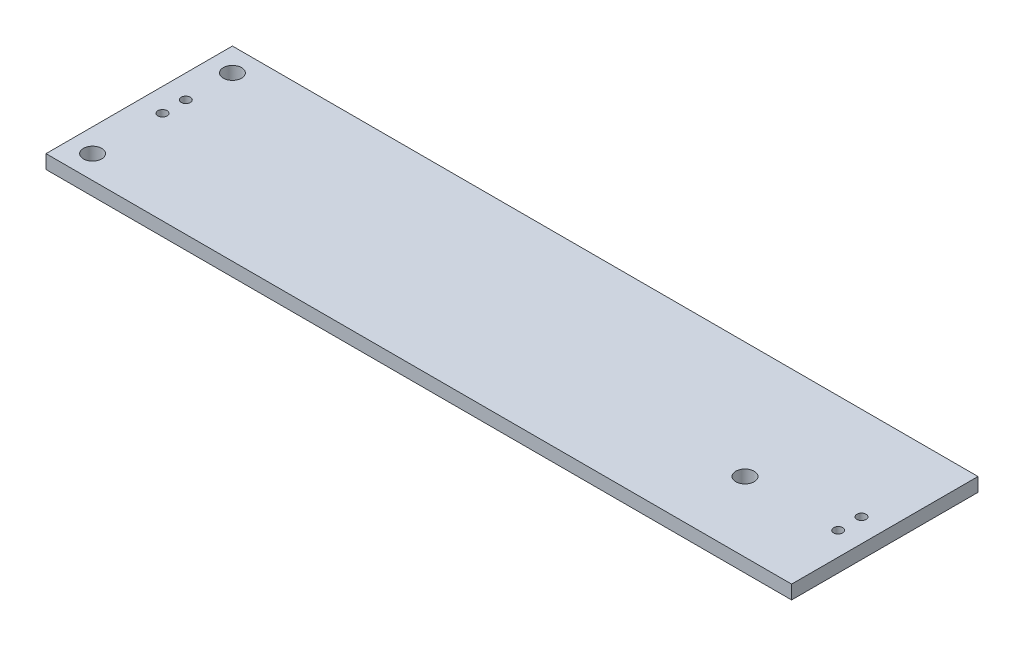
ISO-10303-21;
HEADER;
FILE_DESCRIPTION(('STEP AP214'),'2;1');
FILE_NAME('part.step','',(''),(''),'','','');
FILE_SCHEMA(('AUTOMOTIVE_DESIGN { 1 0 10303 214 1 1 1 1 }'));
ENDSEC;
DATA;
#1=APPLICATION_CONTEXT('core data for automotive mechanical design processes');
#2=APPLICATION_PROTOCOL_DEFINITION('international standard','automotive_design',2000,#1);
#3=PRODUCT_CONTEXT('',#1,'mechanical');
#4=PRODUCT('Part','Part','',(#3));
#5=PRODUCT_RELATED_PRODUCT_CATEGORY('part','',(#4));
#6=PRODUCT_DEFINITION_FORMATION('','',#4);
#7=PRODUCT_DEFINITION_CONTEXT('part definition',#1,'design');
#8=PRODUCT_DEFINITION('design','',#6,#7);
#9=PRODUCT_DEFINITION_SHAPE('','',#8);
#10=(LENGTH_UNIT() NAMED_UNIT(*) SI_UNIT(.MILLI.,.METRE.));
#11=(NAMED_UNIT(*) PLANE_ANGLE_UNIT() SI_UNIT($,.RADIAN.));
#12=(NAMED_UNIT(*) SI_UNIT($,.STERADIAN.) SOLID_ANGLE_UNIT());
#13=UNCERTAINTY_MEASURE_WITH_UNIT(LENGTH_MEASURE(1.E-05),#10,'distance_accuracy_value','');
#14=(GEOMETRIC_REPRESENTATION_CONTEXT(3) GLOBAL_UNCERTAINTY_ASSIGNED_CONTEXT((#13)) GLOBAL_UNIT_ASSIGNED_CONTEXT((#10,
#11,#12)) REPRESENTATION_CONTEXT('',''));
#15=CARTESIAN_POINT('',(0.,0.,0.));
#16=DIRECTION('',(0.,0.,1.));
#17=DIRECTION('',(1.,0.,0.));
#18=AXIS2_PLACEMENT_3D('',#15,#16,#17);
#19=CARTESIAN_POINT('',(2.54,-1.5,-17.78));
#20=DIRECTION('',(0.,1.,0.));
#21=DIRECTION('',(0.,0.,1.));
#22=AXIS2_PLACEMENT_3D('',#19,#20,#21);
#23=CYLINDRICAL_SURFACE('',#22,0.999999999999999);
#24=CARTESIAN_POINT('',(2.54,-1.5,-17.78));
#25=DIRECTION('',(0.,1.,0.));
#26=DIRECTION('',(0.,0.,1.));
#27=AXIS2_PLACEMENT_3D('',#24,#25,#26);
#28=CIRCLE('',#27,0.999999999999999);
#29=CARTESIAN_POINT('',(2.54,-1.5,-16.78));
#30=VERTEX_POINT('',#29);
#31=EDGE_CURVE('E474',#30,#30,#28,.F.);
#32=ORIENTED_EDGE('',*,*,#31,.T.);
#33=EDGE_LOOP('',(#32));
#34=FACE_BOUND('',#33,.T.);
#35=CARTESIAN_POINT('',(2.54,0.,-17.78));
#36=DIRECTION('',(0.,1.,0.));
#37=DIRECTION('',(0.,0.,1.));
#38=AXIS2_PLACEMENT_3D('',#35,#36,#37);
#39=CIRCLE('',#38,0.999999999999999);
#40=CARTESIAN_POINT('',(2.54,0.,-16.78));
#41=VERTEX_POINT('',#40);
#42=EDGE_CURVE('E463',#41,#41,#39,.F.);
#43=ORIENTED_EDGE('',*,*,#42,.F.);
#44=EDGE_LOOP('',(#43));
#45=FACE_BOUND('',#44,.T.);
#46=ADVANCED_FACE('F399',(#34,#45),#23,.F.);
#47=CARTESIAN_POINT('',(68.58,-1.5,-7.62));
#48=DIRECTION('',(0.,1.,0.));
#49=DIRECTION('',(0.,0.,1.));
#50=AXIS2_PLACEMENT_3D('',#47,#48,#49);
#51=CYLINDRICAL_SURFACE('',#50,0.999999999999998);
#52=CARTESIAN_POINT('',(68.58,-1.5,-7.62));
#53=DIRECTION('',(0.,1.,0.));
#54=DIRECTION('',(0.,0.,1.));
#55=AXIS2_PLACEMENT_3D('',#52,#53,#54);
#56=CIRCLE('',#55,0.999999999999998);
#57=CARTESIAN_POINT('',(68.58,-1.5,-6.62));
#58=VERTEX_POINT('',#57);
#59=EDGE_CURVE('E471',#58,#58,#56,.T.);
#60=ORIENTED_EDGE('',*,*,#59,.F.);
#61=EDGE_LOOP('',(#60));
#62=FACE_BOUND('',#61,.T.);
#63=CARTESIAN_POINT('',(68.58,0.,-7.62));
#64=DIRECTION('',(0.,1.,0.));
#65=DIRECTION('',(0.,0.,1.));
#66=AXIS2_PLACEMENT_3D('',#63,#64,#65);
#67=CIRCLE('',#66,0.999999999999998);
#68=CARTESIAN_POINT('',(68.58,0.,-6.62));
#69=VERTEX_POINT('',#68);
#70=EDGE_CURVE('E489',#69,#69,#67,.T.);
#71=ORIENTED_EDGE('',*,*,#70,.T.);
#72=EDGE_LOOP('',(#71));
#73=FACE_BOUND('',#72,.T.);
#74=ADVANCED_FACE('F505',(#62,#73),#51,.F.);
#75=CARTESIAN_POINT('',(2.54,-1.5,-2.54));
#76=DIRECTION('',(0.,1.,0.));
#77=DIRECTION('',(0.,0.,1.));
#78=AXIS2_PLACEMENT_3D('',#75,#76,#77);
#79=CYLINDRICAL_SURFACE('',#78,1.);
#80=CARTESIAN_POINT('',(2.54,-1.5,-2.54));
#81=DIRECTION('',(0.,1.,0.));
#82=DIRECTION('',(0.,0.,1.));
#83=AXIS2_PLACEMENT_3D('',#80,#81,#82);
#84=CIRCLE('',#83,1.);
#85=CARTESIAN_POINT('',(2.54,-1.5,-1.54));
#86=VERTEX_POINT('',#85);
#87=EDGE_CURVE('E468',#86,#86,#84,.T.);
#88=ORIENTED_EDGE('',*,*,#87,.F.);
#89=EDGE_LOOP('',(#88));
#90=FACE_BOUND('',#89,.T.);
#91=CARTESIAN_POINT('',(2.54,0.,-2.54));
#92=DIRECTION('',(0.,1.,0.));
#93=DIRECTION('',(0.,0.,1.));
#94=AXIS2_PLACEMENT_3D('',#91,#92,#93);
#95=CIRCLE('',#94,1.);
#96=CARTESIAN_POINT('',(2.54,0.,-1.54));
#97=VERTEX_POINT('',#96);
#98=EDGE_CURVE('E486',#97,#97,#95,.T.);
#99=ORIENTED_EDGE('',*,*,#98,.T.);
#100=EDGE_LOOP('',(#99));
#101=FACE_BOUND('',#100,.T.);
#102=ADVANCED_FACE('F511',(#90,#101),#79,.F.);
#103=CARTESIAN_POINT('',(0.,-1.5,0.));
#104=DIRECTION('',(1.,0.,0.));
#105=DIRECTION('',(0.,0.,-1.));
#106=AXIS2_PLACEMENT_3D('',#103,#104,#105);
#107=PLANE('',#106);
#108=DIRECTION('',(0.,0.,-1.));
#109=VECTOR('',#108,1.);
#110=CARTESIAN_POINT('',(0.,0.,0.));
#111=LINE('',#110,#109);
#112=CARTESIAN_POINT('',(0.,0.,0.));
#113=VERTEX_POINT('',#112);
#114=CARTESIAN_POINT('',(0.,0.,-20.32));
#115=VERTEX_POINT('',#114);
#116=EDGE_CURVE('E484',#113,#115,#111,.T.);
#117=ORIENTED_EDGE('',*,*,#116,.T.);
#118=DIRECTION('',(0.,1.,0.));
#119=VECTOR('',#118,1.);
#120=CARTESIAN_POINT('',(0.,-1.5,-20.32));
#121=LINE('',#120,#119);
#122=CARTESIAN_POINT('',(0.,-1.5,-20.32));
#123=VERTEX_POINT('',#122);
#124=EDGE_CURVE('E409',#123,#115,#121,.T.);
#125=ORIENTED_EDGE('',*,*,#124,.F.);
#126=DIRECTION('',(0.,0.,-1.));
#127=VECTOR('',#126,1.);
#128=CARTESIAN_POINT('',(0.,-1.5,0.));
#129=LINE('',#128,#127);
#130=CARTESIAN_POINT('',(0.,-1.5,0.));
#131=VERTEX_POINT('',#130);
#132=EDGE_CURVE('E454',#131,#123,#129,.T.);
#133=ORIENTED_EDGE('',*,*,#132,.F.);
#134=DIRECTION('',(0.,1.,0.));
#135=VECTOR('',#134,1.);
#136=CARTESIAN_POINT('',(0.,-1.5,0.));
#137=LINE('',#136,#135);
#138=EDGE_CURVE('E12',#131,#113,#137,.T.);
#139=ORIENTED_EDGE('',*,*,#138,.T.);
#140=EDGE_LOOP('',(#117,#125,#133,#139));
#141=FACE_BOUND('',#140,.T.);
#142=ADVANCED_FACE('F494',(#141),#107,.F.);
#143=CARTESIAN_POINT('',(0.,-1.5,-20.32));
#144=DIRECTION('',(0.,0.,1.));
#145=DIRECTION('',(1.,0.,0.));
#146=AXIS2_PLACEMENT_3D('',#143,#144,#145);
#147=PLANE('',#146);
#148=DIRECTION('',(1.,0.,0.));
#149=VECTOR('',#148,1.);
#150=CARTESIAN_POINT('',(0.,0.,-20.32));
#151=LINE('',#150,#149);
#152=CARTESIAN_POINT('',(81.28,0.,-20.32));
#153=VERTEX_POINT('',#152);
#154=EDGE_CURVE('E434',#115,#153,#151,.T.);
#155=ORIENTED_EDGE('',*,*,#154,.T.);
#156=DIRECTION('',(0.,1.,0.));
#157=VECTOR('',#156,1.);
#158=CARTESIAN_POINT('',(81.28,-1.5,-20.32));
#159=LINE('',#158,#157);
#160=CARTESIAN_POINT('',(81.28,-1.5,-20.32));
#161=VERTEX_POINT('',#160);
#162=EDGE_CURVE('E458',#161,#153,#159,.T.);
#163=ORIENTED_EDGE('',*,*,#162,.F.);
#164=DIRECTION('',(1.,0.,0.));
#165=VECTOR('',#164,1.);
#166=CARTESIAN_POINT('',(0.,-1.5,-20.32));
#167=LINE('',#166,#165);
#168=EDGE_CURVE('E448',#123,#161,#167,.T.);
#169=ORIENTED_EDGE('',*,*,#168,.F.);
#170=ORIENTED_EDGE('',*,*,#124,.T.);
#171=EDGE_LOOP('',(#155,#163,#169,#170));
#172=FACE_BOUND('',#171,.T.);
#173=ADVANCED_FACE('F459',(#172),#147,.F.);
#174=CARTESIAN_POINT('',(81.28,-1.5,0.));
#175=DIRECTION('',(1.,0.,0.));
#176=DIRECTION('',(0.,0.,-1.));
#177=AXIS2_PLACEMENT_3D('',#174,#175,#176);
#178=PLANE('',#177);
#179=DIRECTION('',(0.,0.,-1.));
#180=VECTOR('',#179,1.);
#181=CARTESIAN_POINT('',(81.28,0.,0.));
#182=LINE('',#181,#180);
#183=CARTESIAN_POINT('',(81.28,0.,0.));
#184=VERTEX_POINT('',#183);
#185=EDGE_CURVE('E480',#184,#153,#182,.T.);
#186=ORIENTED_EDGE('',*,*,#185,.F.);
#187=DIRECTION('',(0.,1.,0.));
#188=VECTOR('',#187,1.);
#189=CARTESIAN_POINT('',(81.28,-1.5,0.));
#190=LINE('',#189,#188);
#191=CARTESIAN_POINT('',(81.28,-1.5,0.));
#192=VERTEX_POINT('',#191);
#193=EDGE_CURVE('E403',#192,#184,#190,.T.);
#194=ORIENTED_EDGE('',*,*,#193,.F.);
#195=DIRECTION('',(0.,0.,-1.));
#196=VECTOR('',#195,1.);
#197=CARTESIAN_POINT('',(81.28,-1.5,0.));
#198=LINE('',#197,#196);
#199=EDGE_CURVE('E453',#192,#161,#198,.T.);
#200=ORIENTED_EDGE('',*,*,#199,.T.);
#201=ORIENTED_EDGE('',*,*,#162,.T.);
#202=EDGE_LOOP('',(#186,#194,#200,#201));
#203=FACE_BOUND('',#202,.T.);
#204=ADVANCED_FACE('F460',(#203),#178,.T.);
#205=CARTESIAN_POINT('',(0.,-1.5,0.));
#206=DIRECTION('',(0.,0.,1.));
#207=DIRECTION('',(1.,0.,0.));
#208=AXIS2_PLACEMENT_3D('',#205,#206,#207);
#209=PLANE('',#208);
#210=DIRECTION('',(1.,0.,0.));
#211=VECTOR('',#210,1.);
#212=CARTESIAN_POINT('',(0.,0.,0.));
#213=LINE('',#212,#211);
#214=EDGE_CURVE('E477',#113,#184,#213,.T.);
#215=ORIENTED_EDGE('',*,*,#214,.F.);
#216=ORIENTED_EDGE('',*,*,#138,.F.);
#217=DIRECTION('',(1.,0.,0.));
#218=VECTOR('',#217,1.);
#219=CARTESIAN_POINT('',(0.,-1.5,0.));
#220=LINE('',#219,#218);
#221=EDGE_CURVE('E461',#131,#192,#220,.T.);
#222=ORIENTED_EDGE('',*,*,#221,.T.);
#223=ORIENTED_EDGE('',*,*,#193,.T.);
#224=EDGE_LOOP('',(#215,#216,#222,#223));
#225=FACE_BOUND('',#224,.T.);
#226=ADVANCED_FACE('F401',(#225),#209,.T.);
#227=CARTESIAN_POINT('',(0.,0.,0.));
#228=DIRECTION('',(0.,1.,0.));
#229=DIRECTION('',(0.,0.,1.));
#230=AXIS2_PLACEMENT_3D('',#227,#228,#229);
#231=PLANE('',#230);
#232=CARTESIAN_POINT('',(78.74,0.,-10.1599999999997));
#233=DIRECTION('',(0.,1.,0.));
#234=DIRECTION('',(0.,0.,1.));
#235=AXIS2_PLACEMENT_3D('',#232,#233,#234);
#236=CIRCLE('',#235,0.499999999999998);
#237=CARTESIAN_POINT('',(78.74,0.,-9.65999999999973));
#238=VERTEX_POINT('',#237);
#239=EDGE_CURVE('E635',#238,#238,#236,.T.);
#240=ORIENTED_EDGE('',*,*,#239,.F.);
#241=EDGE_LOOP('',(#240));
#242=FACE_BOUND('',#241,.T.);
#243=CARTESIAN_POINT('',(78.74,0.,-7.61999999999973));
#244=DIRECTION('',(0.,1.,0.));
#245=DIRECTION('',(0.,0.,1.));
#246=AXIS2_PLACEMENT_3D('',#243,#244,#245);
#247=CIRCLE('',#246,0.499999999999998);
#248=CARTESIAN_POINT('',(78.74,0.,-7.11999999999973));
#249=VERTEX_POINT('',#248);
#250=EDGE_CURVE('E641',#249,#249,#247,.T.);
#251=ORIENTED_EDGE('',*,*,#250,.F.);
#252=EDGE_LOOP('',(#251));
#253=FACE_BOUND('',#252,.T.);
#254=CARTESIAN_POINT('',(2.54,0.,-12.7));
#255=DIRECTION('',(0.,1.,0.));
#256=DIRECTION('',(0.,0.,1.));
#257=AXIS2_PLACEMENT_3D('',#254,#255,#256);
#258=CIRCLE('',#257,0.5);
#259=CARTESIAN_POINT('',(2.54,0.,-12.2));
#260=VERTEX_POINT('',#259);
#261=EDGE_CURVE('E647',#260,#260,#258,.T.);
#262=ORIENTED_EDGE('',*,*,#261,.F.);
#263=EDGE_LOOP('',(#262));
#264=FACE_BOUND('',#263,.T.);
#265=CARTESIAN_POINT('',(2.54,0.,-10.16));
#266=DIRECTION('',(0.,1.,0.));
#267=DIRECTION('',(0.,0.,1.));
#268=AXIS2_PLACEMENT_3D('',#265,#266,#267);
#269=CIRCLE('',#268,0.499999999999999);
#270=CARTESIAN_POINT('',(2.54,0.,-9.66));
#271=VERTEX_POINT('',#270);
#272=EDGE_CURVE('E650',#271,#271,#269,.T.);
#273=ORIENTED_EDGE('',*,*,#272,.F.);
#274=EDGE_LOOP('',(#273));
#275=FACE_BOUND('',#274,.T.);
#276=ORIENTED_EDGE('',*,*,#214,.T.);
#277=ORIENTED_EDGE('',*,*,#185,.T.);
#278=ORIENTED_EDGE('',*,*,#154,.F.);
#279=ORIENTED_EDGE('',*,*,#116,.F.);
#280=EDGE_LOOP('',(#276,#277,#278,#279));
#281=FACE_BOUND('',#280,.T.);
#282=ORIENTED_EDGE('',*,*,#98,.F.);
#283=EDGE_LOOP('',(#282));
#284=FACE_BOUND('',#283,.T.);
#285=ORIENTED_EDGE('',*,*,#70,.F.);
#286=EDGE_LOOP('',(#285));
#287=FACE_BOUND('',#286,.T.);
#288=ORIENTED_EDGE('',*,*,#42,.T.);
#289=EDGE_LOOP('',(#288));
#290=FACE_BOUND('',#289,.T.);
#291=ADVANCED_FACE('F495',(#242,#253,#264,#275,#281,#284,#287,#290),#231,.T.);
#292=CARTESIAN_POINT('',(0.,-1.5,0.));
#293=DIRECTION('',(0.,1.,0.));
#294=DIRECTION('',(0.,0.,1.));
#295=AXIS2_PLACEMENT_3D('',#292,#293,#294);
#296=PLANE('',#295);
#297=ORIENTED_EDGE('',*,*,#221,.F.);
#298=ORIENTED_EDGE('',*,*,#132,.T.);
#299=ORIENTED_EDGE('',*,*,#168,.T.);
#300=ORIENTED_EDGE('',*,*,#199,.F.);
#301=EDGE_LOOP('',(#297,#298,#299,#300));
#302=FACE_BOUND('',#301,.T.);
#303=ORIENTED_EDGE('',*,*,#87,.T.);
#304=EDGE_LOOP('',(#303));
#305=FACE_BOUND('',#304,.T.);
#306=ORIENTED_EDGE('',*,*,#59,.T.);
#307=EDGE_LOOP('',(#306));
#308=FACE_BOUND('',#307,.T.);
#309=ORIENTED_EDGE('',*,*,#31,.F.);
#310=EDGE_LOOP('',(#309));
#311=FACE_BOUND('',#310,.T.);
#312=ADVANCED_FACE('F451',(#302,#305,#308,#311),#296,.F.);
#313=CARTESIAN_POINT('',(2.54,-0.762,-10.16));
#314=DIRECTION('',(0.,1.,0.));
#315=DIRECTION('',(0.,0.,1.));
#316=AXIS2_PLACEMENT_3D('',#313,#314,#315);
#317=CYLINDRICAL_SURFACE('',#316,0.499999999999999);
#318=CARTESIAN_POINT('',(2.54,-0.762,-10.16));
#319=DIRECTION('',(0.,1.,0.));
#320=DIRECTION('',(0.,0.,1.));
#321=AXIS2_PLACEMENT_3D('',#318,#319,#320);
#322=CIRCLE('',#321,0.499999999999999);
#323=CARTESIAN_POINT('',(2.54,-0.762,-9.66));
#324=VERTEX_POINT('',#323);
#325=EDGE_CURVE('E481',#324,#324,#322,.T.);
#326=ORIENTED_EDGE('',*,*,#325,.F.);
#327=EDGE_LOOP('',(#326));
#328=FACE_BOUND('',#327,.T.);
#329=ORIENTED_EDGE('',*,*,#272,.T.);
#330=EDGE_LOOP('',(#329));
#331=FACE_BOUND('',#330,.T.);
#332=ADVANCED_FACE('F545',(#328,#331),#317,.F.);
#333=CARTESIAN_POINT('',(2.54,-0.762,-10.16));
#334=DIRECTION('',(0.,1.,0.));
#335=DIRECTION('',(0.,0.,1.));
#336=AXIS2_PLACEMENT_3D('',#333,#334,#335);
#337=PLANE('',#336);
#338=ORIENTED_EDGE('',*,*,#325,.T.);
#339=EDGE_LOOP('',(#338));
#340=FACE_BOUND('',#339,.T.);
#341=ADVANCED_FACE('F558',(#340),#337,.T.);
#342=CARTESIAN_POINT('',(2.54,-0.762,-12.7));
#343=DIRECTION('',(0.,1.,0.));
#344=DIRECTION('',(0.,0.,1.));
#345=AXIS2_PLACEMENT_3D('',#342,#343,#344);
#346=CYLINDRICAL_SURFACE('',#345,0.5);
#347=CARTESIAN_POINT('',(2.54,-0.762,-12.7));
#348=DIRECTION('',(0.,1.,0.));
#349=DIRECTION('',(0.,0.,1.));
#350=AXIS2_PLACEMENT_3D('',#347,#348,#349);
#351=CIRCLE('',#350,0.5);
#352=CARTESIAN_POINT('',(2.54,-0.762,-12.2));
#353=VERTEX_POINT('',#352);
#354=EDGE_CURVE('E644',#353,#353,#351,.T.);
#355=ORIENTED_EDGE('',*,*,#354,.F.);
#356=EDGE_LOOP('',(#355));
#357=FACE_BOUND('',#356,.T.);
#358=ORIENTED_EDGE('',*,*,#261,.T.);
#359=EDGE_LOOP('',(#358));
#360=FACE_BOUND('',#359,.T.);
#361=ADVANCED_FACE('F568',(#357,#360),#346,.F.);
#362=CARTESIAN_POINT('',(2.54,-0.762,-12.7));
#363=DIRECTION('',(0.,1.,0.));
#364=DIRECTION('',(0.,0.,1.));
#365=AXIS2_PLACEMENT_3D('',#362,#363,#364);
#366=PLANE('',#365);
#367=ORIENTED_EDGE('',*,*,#354,.T.);
#368=EDGE_LOOP('',(#367));
#369=FACE_BOUND('',#368,.T.);
#370=ADVANCED_FACE('F578',(#369),#366,.T.);
#371=CARTESIAN_POINT('',(78.74,-0.762,-7.61999999999973));
#372=DIRECTION('',(0.,1.,0.));
#373=DIRECTION('',(0.,0.,1.));
#374=AXIS2_PLACEMENT_3D('',#371,#372,#373);
#375=CYLINDRICAL_SURFACE('',#374,0.499999999999998);
#376=CARTESIAN_POINT('',(78.74,-0.762,-7.61999999999973));
#377=DIRECTION('',(0.,1.,0.));
#378=DIRECTION('',(0.,0.,1.));
#379=AXIS2_PLACEMENT_3D('',#376,#377,#378);
#380=CIRCLE('',#379,0.499999999999998);
#381=CARTESIAN_POINT('',(78.74,-0.762,-7.11999999999973));
#382=VERTEX_POINT('',#381);
#383=EDGE_CURVE('E638',#382,#382,#380,.T.);
#384=ORIENTED_EDGE('',*,*,#383,.F.);
#385=EDGE_LOOP('',(#384));
#386=FACE_BOUND('',#385,.T.);
#387=ORIENTED_EDGE('',*,*,#250,.T.);
#388=EDGE_LOOP('',(#387));
#389=FACE_BOUND('',#388,.T.);
#390=ADVANCED_FACE('F588',(#386,#389),#375,.F.);
#391=CARTESIAN_POINT('',(78.74,-0.762,-7.61999999999973));
#392=DIRECTION('',(0.,1.,0.));
#393=DIRECTION('',(0.,0.,1.));
#394=AXIS2_PLACEMENT_3D('',#391,#392,#393);
#395=PLANE('',#394);
#396=ORIENTED_EDGE('',*,*,#383,.T.);
#397=EDGE_LOOP('',(#396));
#398=FACE_BOUND('',#397,.T.);
#399=ADVANCED_FACE('F598',(#398),#395,.T.);
#400=CARTESIAN_POINT('',(78.74,-0.762,-10.1599999999997));
#401=DIRECTION('',(0.,1.,0.));
#402=DIRECTION('',(0.,0.,1.));
#403=AXIS2_PLACEMENT_3D('',#400,#401,#402);
#404=CYLINDRICAL_SURFACE('',#403,0.499999999999998);
#405=CARTESIAN_POINT('',(78.74,-0.762,-10.1599999999997));
#406=DIRECTION('',(0.,1.,0.));
#407=DIRECTION('',(0.,0.,1.));
#408=AXIS2_PLACEMENT_3D('',#405,#406,#407);
#409=CIRCLE('',#408,0.499999999999998);
#410=CARTESIAN_POINT('',(78.74,-0.762,-9.65999999999973));
#411=VERTEX_POINT('',#410);
#412=EDGE_CURVE('E634',#411,#411,#409,.T.);
#413=ORIENTED_EDGE('',*,*,#412,.F.);
#414=EDGE_LOOP('',(#413));
#415=FACE_BOUND('',#414,.T.);
#416=ORIENTED_EDGE('',*,*,#239,.T.);
#417=EDGE_LOOP('',(#416));
#418=FACE_BOUND('',#417,.T.);
#419=ADVANCED_FACE('F608',(#415,#418),#404,.F.);
#420=CARTESIAN_POINT('',(78.74,-0.762,-10.1599999999997));
#421=DIRECTION('',(0.,1.,0.));
#422=DIRECTION('',(0.,0.,1.));
#423=AXIS2_PLACEMENT_3D('',#420,#421,#422);
#424=PLANE('',#423);
#425=ORIENTED_EDGE('',*,*,#412,.T.);
#426=EDGE_LOOP('',(#425));
#427=FACE_BOUND('',#426,.T.);
#428=ADVANCED_FACE('F618',(#427),#424,.T.);
#429=CLOSED_SHELL('',(#46,#74,#102,#142,#173,#204,#226,#291,#312,#332,#341,#361,#370,#390,#399,
#419,#428));
#430=MANIFOLD_SOLID_BREP('B2',#429);
#431=ADVANCED_BREP_SHAPE_REPRESENTATION('',(#18,#430),#14);
#432=SHAPE_DEFINITION_REPRESENTATION(#9,#431);
ENDSEC;
END-ISO-10303-21;
